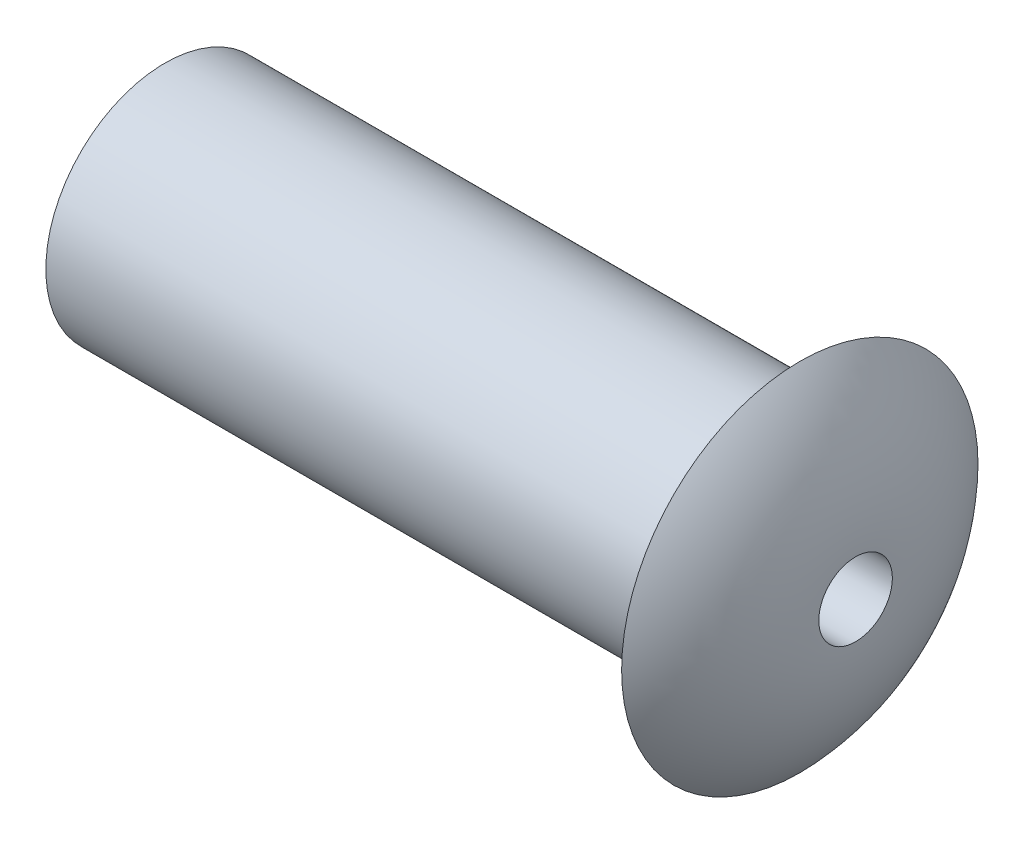
ISO-10303-21;
HEADER;
FILE_DESCRIPTION(('STEP AP214'),'2;1');
FILE_NAME('part.step','',(''),(''),'','','');
FILE_SCHEMA(('AUTOMOTIVE_DESIGN { 1 0 10303 214 1 1 1 1 }'));
ENDSEC;
DATA;
#1=APPLICATION_CONTEXT('core data for automotive mechanical design processes');
#2=APPLICATION_PROTOCOL_DEFINITION('international standard','automotive_design',2000,#1);
#3=PRODUCT_CONTEXT('',#1,'mechanical');
#4=PRODUCT('Part','Part','',(#3));
#5=PRODUCT_RELATED_PRODUCT_CATEGORY('part','',(#4));
#6=PRODUCT_DEFINITION_FORMATION('','',#4);
#7=PRODUCT_DEFINITION_CONTEXT('part definition',#1,'design');
#8=PRODUCT_DEFINITION('design','',#6,#7);
#9=PRODUCT_DEFINITION_SHAPE('','',#8);
#10=(LENGTH_UNIT() NAMED_UNIT(*) SI_UNIT(.MILLI.,.METRE.));
#11=(NAMED_UNIT(*) PLANE_ANGLE_UNIT() SI_UNIT($,.RADIAN.));
#12=(NAMED_UNIT(*) SI_UNIT($,.STERADIAN.) SOLID_ANGLE_UNIT());
#13=UNCERTAINTY_MEASURE_WITH_UNIT(LENGTH_MEASURE(1.E-05),#10,'distance_accuracy_value','');
#14=(GEOMETRIC_REPRESENTATION_CONTEXT(3) GLOBAL_UNCERTAINTY_ASSIGNED_CONTEXT((#13)) GLOBAL_UNIT_ASSIGNED_CONTEXT((#10,
#11,#12)) REPRESENTATION_CONTEXT('',''));
#15=CARTESIAN_POINT('',(0.,0.,0.));
#16=DIRECTION('',(0.,0.,1.));
#17=DIRECTION('',(1.,0.,0.));
#18=AXIS2_PLACEMENT_3D('',#15,#16,#17);
#19=CARTESIAN_POINT('',(72.9692086330936,21.8,223.));
#20=DIRECTION('',(1.,0.,0.));
#21=DIRECTION('',(0.,0.,-1.));
#22=AXIS2_PLACEMENT_3D('',#19,#20,#21);
#23=CYLINDRICAL_SURFACE('',#22,1.87499999999999);
#24=CARTESIAN_POINT('',(72.9692086330936,21.8,223.));
#25=DIRECTION('',(1.,0.,0.));
#26=DIRECTION('',(0.,0.,-1.));
#27=AXIS2_PLACEMENT_3D('',#24,#25,#26);
#28=CIRCLE('',#27,1.87499999999999);
#29=CARTESIAN_POINT('',(72.9692086330936,21.8,221.125));
#30=VERTEX_POINT('',#29);
#31=EDGE_CURVE('E12',#30,#30,#28,.T.);
#32=ORIENTED_EDGE('',*,*,#31,.T.);
#33=EDGE_LOOP('',(#32));
#34=FACE_BOUND('',#33,.T.);
#35=CARTESIAN_POINT('',(82.9692086330936,21.8,223.));
#36=DIRECTION('',(1.,0.,0.));
#37=DIRECTION('',(0.,0.,-1.));
#38=AXIS2_PLACEMENT_3D('',#35,#36,#37);
#39=CIRCLE('',#38,1.87499999999999);
#40=CARTESIAN_POINT('',(82.9692086330936,21.8,221.125));
#41=VERTEX_POINT('',#40);
#42=EDGE_CURVE('E47',#41,#41,#39,.T.);
#43=ORIENTED_EDGE('',*,*,#42,.F.);
#44=EDGE_LOOP('',(#43));
#45=FACE_BOUND('',#44,.T.);
#46=ADVANCED_FACE('F44',(#34,#45),#23,.T.);
#47=CARTESIAN_POINT('',(72.9692086330936,21.8,223.));
#48=DIRECTION('',(1.,0.,0.));
#49=DIRECTION('',(0.,0.,-1.));
#50=AXIS2_PLACEMENT_3D('',#47,#48,#49);
#51=PLANE('',#50);
#52=ORIENTED_EDGE('',*,*,#31,.F.);
#53=EDGE_LOOP('',(#52));
#54=FACE_BOUND('',#53,.T.);
#55=ADVANCED_FACE('F81',(#54),#51,.F.);
#56=CARTESIAN_POINT('',(82.9692086330936,0.,223.));
#57=DIRECTION('',(1.,0.,0.));
#58=DIRECTION('',(0.,0.,-1.));
#59=AXIS2_PLACEMENT_3D('',#56,#57,#58);
#60=PLANE('',#59);
#61=ORIENTED_EDGE('',*,*,#42,.T.);
#62=EDGE_LOOP('',(#61));
#63=FACE_BOUND('',#62,.T.);
#64=CARTESIAN_POINT('',(82.9692086330936,21.8,223.));
#65=DIRECTION('',(-1.,0.,0.));
#66=DIRECTION('',(0.,0.,1.));
#67=AXIS2_PLACEMENT_3D('',#64,#65,#66);
#68=CIRCLE('',#67,2.80642688319493);
#69=CARTESIAN_POINT('',(82.9692086330936,21.8,225.806426883195));
#70=VERTEX_POINT('',#69);
#71=EDGE_CURVE('E54',#70,#70,#68,.T.);
#72=ORIENTED_EDGE('',*,*,#71,.T.);
#73=EDGE_LOOP('',(#72));
#74=FACE_BOUND('',#73,.T.);
#75=ADVANCED_FACE('F75',(#63,#74),#60,.F.);
#76=CARTESIAN_POINT('',(80.5851732342331,21.8,223.));
#77=DIRECTION('',(-1.,0.,0.));
#78=DIRECTION('',(0.,0.,1.));
#79=AXIS2_PLACEMENT_3D('',#76,#77,#78);
#80=DEGENERATE_TOROIDAL_SURFACE('',#79,0.579460837125925,3.26236149949151,.T.);
#81=ORIENTED_EDGE('',*,*,#71,.F.);
#82=EDGE_LOOP('',(#81));
#83=FACE_BOUND('',#82,.T.);
#84=CARTESIAN_POINT('',(83.8475347337246,21.8,223.));
#85=DIRECTION('',(1.,0.,0.));
#86=DIRECTION('',(0.,0.,-1.));
#87=AXIS2_PLACEMENT_3D('',#84,#85,#86);
#88=CIRCLE('',#87,0.57946083712594);
#89=CARTESIAN_POINT('',(83.8475347337246,21.8,222.420539162874));
#90=VERTEX_POINT('',#89);
#91=EDGE_CURVE('E59',#90,#90,#88,.T.);
#92=ORIENTED_EDGE('',*,*,#91,.F.);
#93=EDGE_LOOP('',(#92));
#94=FACE_BOUND('',#93,.T.);
#95=ADVANCED_FACE('F70',(#83,#94),#80,.T.);
#96=CARTESIAN_POINT('',(82.8475347337246,21.8,223.));
#97=DIRECTION('',(1.,0.,0.));
#98=DIRECTION('',(0.,0.,-1.));
#99=AXIS2_PLACEMENT_3D('',#96,#97,#98);
#100=CYLINDRICAL_SURFACE('',#99,0.57946083712594);
#101=CARTESIAN_POINT('',(82.8475347337246,21.8,223.));
#102=DIRECTION('',(1.,0.,0.));
#103=DIRECTION('',(0.,0.,-1.));
#104=AXIS2_PLACEMENT_3D('',#101,#102,#103);
#105=CIRCLE('',#104,0.57946083712594);
#106=CARTESIAN_POINT('',(82.8475347337246,21.8,222.420539162874));
#107=VERTEX_POINT('',#106);
#108=EDGE_CURVE('E58',#107,#107,#105,.T.);
#109=ORIENTED_EDGE('',*,*,#108,.F.);
#110=EDGE_LOOP('',(#109));
#111=FACE_BOUND('',#110,.T.);
#112=ORIENTED_EDGE('',*,*,#91,.T.);
#113=EDGE_LOOP('',(#112));
#114=FACE_BOUND('',#113,.T.);
#115=ADVANCED_FACE('F67',(#111,#114),#100,.F.);
#116=CARTESIAN_POINT('',(82.8475347337246,21.8,223.));
#117=DIRECTION('',(1.,0.,0.));
#118=DIRECTION('',(0.,0.,-1.));
#119=AXIS2_PLACEMENT_3D('',#116,#117,#118);
#120=PLANE('',#119);
#121=ORIENTED_EDGE('',*,*,#108,.T.);
#122=EDGE_LOOP('',(#121));
#123=FACE_BOUND('',#122,.T.);
#124=ADVANCED_FACE('F65',(#123),#120,.T.);
#125=CLOSED_SHELL('',(#46,#55,#75,#95,#115,#124));
#126=MANIFOLD_SOLID_BREP('B2',#125);
#127=ADVANCED_BREP_SHAPE_REPRESENTATION('',(#18,#126),#14);
#128=SHAPE_DEFINITION_REPRESENTATION(#9,#127);
ENDSEC;
END-ISO-10303-21;
